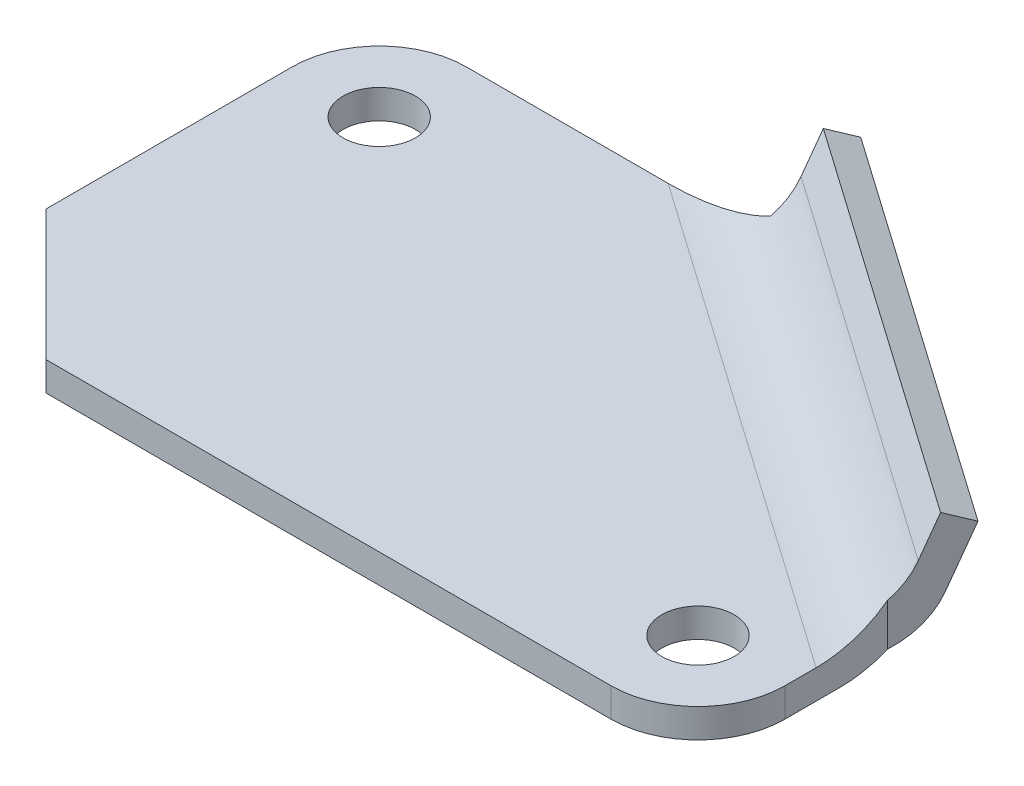
ISO-10303-21;
HEADER;
FILE_DESCRIPTION(('STEP AP214'),'2;1');
FILE_NAME('part.step','',(''),(''),'','','');
FILE_SCHEMA(('AUTOMOTIVE_DESIGN { 1 0 10303 214 1 1 1 1 }'));
ENDSEC;
DATA;
#1=APPLICATION_CONTEXT('core data for automotive mechanical design processes');
#2=APPLICATION_PROTOCOL_DEFINITION('international standard','automotive_design',2000,#1);
#3=PRODUCT_CONTEXT('',#1,'mechanical');
#4=PRODUCT('Part','Part','',(#3));
#5=PRODUCT_RELATED_PRODUCT_CATEGORY('part','',(#4));
#6=PRODUCT_DEFINITION_FORMATION('','',#4);
#7=PRODUCT_DEFINITION_CONTEXT('part definition',#1,'design');
#8=PRODUCT_DEFINITION('design','',#6,#7);
#9=PRODUCT_DEFINITION_SHAPE('','',#8);
#10=(LENGTH_UNIT() NAMED_UNIT(*) SI_UNIT(.MILLI.,.METRE.));
#11=(NAMED_UNIT(*) PLANE_ANGLE_UNIT() SI_UNIT($,.RADIAN.));
#12=(NAMED_UNIT(*) SI_UNIT($,.STERADIAN.) SOLID_ANGLE_UNIT());
#13=UNCERTAINTY_MEASURE_WITH_UNIT(LENGTH_MEASURE(1.E-05),#10,'distance_accuracy_value','');
#14=(GEOMETRIC_REPRESENTATION_CONTEXT(3) GLOBAL_UNCERTAINTY_ASSIGNED_CONTEXT((#13)) GLOBAL_UNIT_ASSIGNED_CONTEXT((#10,
#11,#12)) REPRESENTATION_CONTEXT('',''));
#15=CARTESIAN_POINT('',(0.,0.,0.));
#16=DIRECTION('',(0.,0.,1.));
#17=DIRECTION('',(1.,0.,0.));
#18=AXIS2_PLACEMENT_3D('',#15,#16,#17);
#19=CARTESIAN_POINT('',(96.,2.,-12.));
#20=DIRECTION('',(0.,1.,0.));
#21=DIRECTION('',(0.,0.,1.));
#22=AXIS2_PLACEMENT_3D('',#19,#20,#21);
#23=PLANE('',#22);
#24=CARTESIAN_POINT('',(12.,2.,-52.));
#25=DIRECTION('',(0.,1.,0.));
#26=DIRECTION('',(0.,0.,1.));
#27=AXIS2_PLACEMENT_3D('',#24,#25,#26);
#28=CIRCLE('',#27,5.);
#29=CARTESIAN_POINT('',(12.,2.,-47.));
#30=VERTEX_POINT('',#29);
#31=EDGE_CURVE('E194',#30,#30,#28,.T.);
#32=ORIENTED_EDGE('',*,*,#31,.F.);
#33=EDGE_LOOP('',(#32));
#34=FACE_BOUND('',#33,.T.);
#35=DIRECTION('',(0.,0.,-1.));
#36=VECTOR('',#35,1.);
#37=CARTESIAN_POINT('',(108.,2.,-12.0000000000001));
#38=LINE('',#37,#36);
#39=CARTESIAN_POINT('',(108.,2.,-12.0000000000001));
#40=VERTEX_POINT('',#39);
#41=CARTESIAN_POINT('',(108.,2.,-16.3077186495026));
#42=VERTEX_POINT('',#41);
#43=EDGE_CURVE('E206',#40,#42,#38,.T.);
#44=ORIENTED_EDGE('',*,*,#43,.T.);
#45=DIRECTION('',(-0.819152044288989,0.,-0.57357643635105));
#46=VECTOR('',#45,1.);
#47=CARTESIAN_POINT('',(49.3574137034532,2.,-57.3696996344585));
#48=LINE('',#47,#46);
#49=CARTESIAN_POINT('',(39.8883634523036,2.,-64.));
#50=VERTEX_POINT('',#49);
#51=EDGE_CURVE('E293',#42,#50,#48,.T.);
#52=ORIENTED_EDGE('',*,*,#51,.T.);
#53=DIRECTION('',(-1.,0.,0.));
#54=VECTOR('',#53,1.);
#55=CARTESIAN_POINT('',(12.0000000000001,2.,-64.));
#56=LINE('',#55,#54);
#57=CARTESIAN_POINT('',(12.,2.,-64.));
#58=VERTEX_POINT('',#57);
#59=EDGE_CURVE('E211',#50,#58,#56,.T.);
#60=ORIENTED_EDGE('',*,*,#59,.T.);
#61=CARTESIAN_POINT('',(12.,2.,-52.));
#62=DIRECTION('',(0.,1.,0.));
#63=DIRECTION('',(0.,0.,-1.));
#64=AXIS2_PLACEMENT_3D('',#61,#62,#63);
#65=CIRCLE('',#64,12.);
#66=CARTESIAN_POINT('',(0.,2.,-51.9999999999999));
#67=VERTEX_POINT('',#66);
#68=EDGE_CURVE('E214',#58,#67,#65,.T.);
#69=ORIENTED_EDGE('',*,*,#68,.T.);
#70=DIRECTION('',(0.,0.,1.));
#71=VECTOR('',#70,1.);
#72=CARTESIAN_POINT('',(0.,2.,-18.));
#73=LINE('',#72,#71);
#74=CARTESIAN_POINT('',(0.,2.,-18.));
#75=VERTEX_POINT('',#74);
#76=EDGE_CURVE('E217',#67,#75,#73,.T.);
#77=ORIENTED_EDGE('',*,*,#76,.T.);
#78=DIRECTION('',(0.707106781186547,0.,0.707106781186547));
#79=VECTOR('',#78,1.);
#80=CARTESIAN_POINT('',(0.,2.,-18.));
#81=LINE('',#80,#79);
#82=CARTESIAN_POINT('',(18.,2.,0.));
#83=VERTEX_POINT('',#82);
#84=EDGE_CURVE('E220',#75,#83,#81,.T.);
#85=ORIENTED_EDGE('',*,*,#84,.T.);
#86=DIRECTION('',(1.,0.,0.));
#87=VECTOR('',#86,1.);
#88=CARTESIAN_POINT('',(18.,2.,0.));
#89=LINE('',#88,#87);
#90=CARTESIAN_POINT('',(95.9999999999999,2.,0.));
#91=VERTEX_POINT('',#90);
#92=EDGE_CURVE('E223',#83,#91,#89,.T.);
#93=ORIENTED_EDGE('',*,*,#92,.T.);
#94=CARTESIAN_POINT('',(96.,2.,-12.));
#95=DIRECTION('',(0.,1.,0.));
#96=DIRECTION('',(0.,0.,1.));
#97=AXIS2_PLACEMENT_3D('',#94,#95,#96);
#98=CIRCLE('',#97,12.);
#99=EDGE_CURVE('E202',#91,#40,#98,.T.);
#100=ORIENTED_EDGE('',*,*,#99,.T.);
#101=EDGE_LOOP('',(#44,#52,#60,#69,#77,#85,#93,#100));
#102=FACE_BOUND('',#101,.T.);
#103=CARTESIAN_POINT('',(96.,2.,-12.));
#104=DIRECTION('',(0.,1.,0.));
#105=DIRECTION('',(0.,0.,1.));
#106=AXIS2_PLACEMENT_3D('',#103,#104,#105);
#107=CIRCLE('',#106,5.);
#108=CARTESIAN_POINT('',(96.,2.,-6.99999999999999));
#109=VERTEX_POINT('',#108);
#110=EDGE_CURVE('E186',#109,#109,#107,.T.);
#111=ORIENTED_EDGE('',*,*,#110,.F.);
#112=EDGE_LOOP('',(#111));
#113=FACE_BOUND('',#112,.T.);
#114=ADVANCED_FACE('F43',(#34,#102,#113),#23,.T.);
#115=CARTESIAN_POINT('',(96.,-2.,-12.));
#116=DIRECTION('',(0.,1.,0.));
#117=DIRECTION('',(0.,0.,1.));
#118=AXIS2_PLACEMENT_3D('',#115,#116,#117);
#119=PLANE('',#118);
#120=DIRECTION('',(-1.,0.,0.));
#121=VECTOR('',#120,1.);
#122=CARTESIAN_POINT('',(12.0000000000001,-2.,-64.));
#123=LINE('',#122,#121);
#124=CARTESIAN_POINT('',(44.5922423015359,-2.,-64.));
#125=VERTEX_POINT('',#124);
#126=CARTESIAN_POINT('',(12.,-2.,-64.));
#127=VERTEX_POINT('',#126);
#128=EDGE_CURVE('E234',#125,#127,#123,.T.);
#129=ORIENTED_EDGE('',*,*,#128,.F.);
#130=DIRECTION('',(0.819152044288989,0.,0.57357643635105));
#131=VECTOR('',#130,1.);
#132=CARTESIAN_POINT('',(104.904942468969,-2.,-21.7685926929811));
#133=LINE('',#132,#131);
#134=CARTESIAN_POINT('',(108.,-2.,-19.6014100785602));
#135=VERTEX_POINT('',#134);
#136=EDGE_CURVE('E275',#125,#135,#133,.T.);
#137=ORIENTED_EDGE('',*,*,#136,.T.);
#138=DIRECTION('',(0.,0.,-1.));
#139=VECTOR('',#138,1.);
#140=CARTESIAN_POINT('',(108.,-2.,-12.0000000000001));
#141=LINE('',#140,#139);
#142=CARTESIAN_POINT('',(108.,-2.,-12.0000000000001));
#143=VERTEX_POINT('',#142);
#144=EDGE_CURVE('E230',#143,#135,#141,.T.);
#145=ORIENTED_EDGE('',*,*,#144,.F.);
#146=CARTESIAN_POINT('',(96.,-2.,-12.));
#147=DIRECTION('',(0.,1.,0.));
#148=DIRECTION('',(0.,0.,1.));
#149=AXIS2_PLACEMENT_3D('',#146,#147,#148);
#150=CIRCLE('',#149,12.);
#151=CARTESIAN_POINT('',(95.9999999999999,-2.,0.));
#152=VERTEX_POINT('',#151);
#153=EDGE_CURVE('E198',#152,#143,#150,.T.);
#154=ORIENTED_EDGE('',*,*,#153,.F.);
#155=DIRECTION('',(1.,0.,0.));
#156=VECTOR('',#155,1.);
#157=CARTESIAN_POINT('',(18.,-2.,0.));
#158=LINE('',#157,#156);
#159=CARTESIAN_POINT('',(18.,-2.,0.));
#160=VERTEX_POINT('',#159);
#161=EDGE_CURVE('E207',#160,#152,#158,.T.);
#162=ORIENTED_EDGE('',*,*,#161,.F.);
#163=DIRECTION('',(0.707106781186547,0.,0.707106781186547));
#164=VECTOR('',#163,1.);
#165=CARTESIAN_POINT('',(0.,-2.,-18.));
#166=LINE('',#165,#164);
#167=CARTESIAN_POINT('',(0.,-2.,-18.));
#168=VERTEX_POINT('',#167);
#169=EDGE_CURVE('E243',#168,#160,#166,.T.);
#170=ORIENTED_EDGE('',*,*,#169,.F.);
#171=DIRECTION('',(0.,0.,1.));
#172=VECTOR('',#171,1.);
#173=CARTESIAN_POINT('',(0.,-2.,-18.));
#174=LINE('',#173,#172);
#175=CARTESIAN_POINT('',(0.,-2.,-51.9999999999999));
#176=VERTEX_POINT('',#175);
#177=EDGE_CURVE('E240',#176,#168,#174,.T.);
#178=ORIENTED_EDGE('',*,*,#177,.F.);
#179=CARTESIAN_POINT('',(12.,-2.,-52.));
#180=DIRECTION('',(0.,1.,0.));
#181=DIRECTION('',(0.,0.,-1.));
#182=AXIS2_PLACEMENT_3D('',#179,#180,#181);
#183=CIRCLE('',#182,12.);
#184=EDGE_CURVE('E237',#127,#176,#183,.T.);
#185=ORIENTED_EDGE('',*,*,#184,.F.);
#186=EDGE_LOOP('',(#129,#137,#145,#154,#162,#170,#178,#185));
#187=FACE_BOUND('',#186,.T.);
#188=CARTESIAN_POINT('',(12.,-2.,-52.));
#189=DIRECTION('',(0.,1.,0.));
#190=DIRECTION('',(0.,0.,1.));
#191=AXIS2_PLACEMENT_3D('',#188,#189,#190);
#192=CIRCLE('',#191,5.);
#193=CARTESIAN_POINT('',(12.,-2.,-47.));
#194=VERTEX_POINT('',#193);
#195=EDGE_CURVE('E190',#194,#194,#192,.T.);
#196=ORIENTED_EDGE('',*,*,#195,.T.);
#197=EDGE_LOOP('',(#196));
#198=FACE_BOUND('',#197,.T.);
#199=CARTESIAN_POINT('',(96.,-2.,-12.));
#200=DIRECTION('',(0.,1.,0.));
#201=DIRECTION('',(0.,0.,1.));
#202=AXIS2_PLACEMENT_3D('',#199,#200,#201);
#203=CIRCLE('',#202,5.);
#204=CARTESIAN_POINT('',(96.,-2.,-6.99999999999999));
#205=VERTEX_POINT('',#204);
#206=EDGE_CURVE('E184',#205,#205,#203,.T.);
#207=ORIENTED_EDGE('',*,*,#206,.T.);
#208=EDGE_LOOP('',(#207));
#209=FACE_BOUND('',#208,.T.);
#210=ADVANCED_FACE('F328',(#187,#198,#209),#119,.F.);
#211=CARTESIAN_POINT('',(96.,2.,-12.));
#212=DIRECTION('',(0.,-1.,0.));
#213=DIRECTION('',(0.,0.,-1.));
#214=AXIS2_PLACEMENT_3D('',#211,#212,#213);
#215=CYLINDRICAL_SURFACE('',#214,12.);
#216=ORIENTED_EDGE('',*,*,#153,.T.);
#217=DIRECTION('',(0.,-1.,0.));
#218=VECTOR('',#217,1.);
#219=CARTESIAN_POINT('',(108.,2.,-12.0000000000001));
#220=LINE('',#219,#218);
#221=EDGE_CURVE('E271',#40,#143,#220,.T.);
#222=ORIENTED_EDGE('',*,*,#221,.F.);
#223=ORIENTED_EDGE('',*,*,#99,.F.);
#224=DIRECTION('',(0.,-1.,0.));
#225=VECTOR('',#224,1.);
#226=CARTESIAN_POINT('',(95.9999999999999,2.,0.));
#227=LINE('',#226,#225);
#228=EDGE_CURVE('E226',#91,#152,#227,.T.);
#229=ORIENTED_EDGE('',*,*,#228,.T.);
#230=EDGE_LOOP('',(#216,#222,#223,#229));
#231=FACE_BOUND('',#230,.T.);
#232=ADVANCED_FACE('F324',(#231),#215,.T.);
#233=CARTESIAN_POINT('',(108.,2.,-12.0000000000001));
#234=DIRECTION('',(-1.,0.,0.));
#235=DIRECTION('',(0.,0.,1.));
#236=AXIS2_PLACEMENT_3D('',#233,#234,#235);
#237=PLANE('',#236);
#238=ORIENTED_EDGE('',*,*,#144,.T.);
#239=CARTESIAN_POINT('',(108.,10.,-19.6014100785602));
#240=DIRECTION('',(-1.,0.,0.));
#241=DIRECTION('',(0.,0.,-1.));
#242=AXIS2_PLACEMENT_3D('',#239,#240,#241);
#243=ELLIPSE('',#242,14.6492950651375,12.);
#244=CARTESIAN_POINT('',(108.,-0.718323035123066,-26.1887929366756));
#245=VERTEX_POINT('',#244);
#246=EDGE_CURVE('E279',#135,#245,#243,.F.);
#247=ORIENTED_EDGE('',*,*,#246,.T.);
#248=DIRECTION('',(0.,-1.,0.));
#249=VECTOR('',#248,1.);
#250=CARTESIAN_POINT('',(108.,2.,-26.1887929366756));
#251=LINE('',#250,#249);
#252=CARTESIAN_POINT('',(108.,5.14079520826996,-26.1887929366756));
#253=VERTEX_POINT('',#252);
#254=EDGE_CURVE('E58',#253,#245,#251,.T.);
#255=ORIENTED_EDGE('',*,*,#254,.F.);
#256=CARTESIAN_POINT('',(108.,14.,-16.3077186495026));
#257=DIRECTION('',(-1.,0.,0.));
#258=DIRECTION('',(0.,0.,1.));
#259=AXIS2_PLACEMENT_3D('',#256,#257,#258);
#260=ELLIPSE('',#259,14.6492950651375,12.);
#261=EDGE_CURVE('E11',#253,#42,#260,.T.);
#262=ORIENTED_EDGE('',*,*,#261,.T.);
#263=ORIENTED_EDGE('',*,*,#43,.F.);
#264=ORIENTED_EDGE('',*,*,#221,.T.);
#265=EDGE_LOOP('',(#238,#247,#255,#262,#263,#264));
#266=FACE_BOUND('',#265,.T.);
#267=ADVANCED_FACE('F315',(#266),#237,.F.);
#268=CARTESIAN_POINT('',(12.0000000000001,2.,-64.));
#269=DIRECTION('',(0.,0.,1.));
#270=DIRECTION('',(1.,0.,0.));
#271=AXIS2_PLACEMENT_3D('',#268,#269,#270);
#272=PLANE('',#271);
#273=DIRECTION('',(0.,-1.,0.));
#274=VECTOR('',#273,1.);
#275=CARTESIAN_POINT('',(54.,2.,-64.));
#276=LINE('',#275,#274);
#277=CARTESIAN_POINT('',(54.,5.14079520826979,-64.));
#278=VERTEX_POINT('',#277);
#279=CARTESIAN_POINT('',(54.,-0.718323035123179,-64.));
#280=VERTEX_POINT('',#279);
#281=EDGE_CURVE('E66',#278,#280,#276,.T.);
#282=ORIENTED_EDGE('',*,*,#281,.T.);
#283=CARTESIAN_POINT('',(44.5922423015359,10.,-64.));
#284=DIRECTION('',(0.,0.,1.));
#285=DIRECTION('',(-1.,0.,0.));
#286=AXIS2_PLACEMENT_3D('',#283,#284,#285);
#287=ELLIPSE('',#286,20.921361547453,12.);
#288=EDGE_CURVE('E290',#280,#125,#287,.F.);
#289=ORIENTED_EDGE('',*,*,#288,.T.);
#290=ORIENTED_EDGE('',*,*,#128,.T.);
#291=DIRECTION('',(0.,-1.,0.));
#292=VECTOR('',#291,1.);
#293=CARTESIAN_POINT('',(12.,2.,-64.));
#294=LINE('',#293,#292);
#295=EDGE_CURVE('E263',#58,#127,#294,.T.);
#296=ORIENTED_EDGE('',*,*,#295,.F.);
#297=ORIENTED_EDGE('',*,*,#59,.F.);
#298=CARTESIAN_POINT('',(39.8883634523036,14.,-64.));
#299=DIRECTION('',(0.,0.,1.));
#300=DIRECTION('',(1.,0.,0.));
#301=AXIS2_PLACEMENT_3D('',#298,#299,#300);
#302=ELLIPSE('',#301,20.921361547453,12.);
#303=EDGE_CURVE('E300',#50,#278,#302,.T.);
#304=ORIENTED_EDGE('',*,*,#303,.T.);
#305=EDGE_LOOP('',(#282,#289,#290,#296,#297,#304));
#306=FACE_BOUND('',#305,.T.);
#307=ADVANCED_FACE('F340',(#306),#272,.F.);
#308=CARTESIAN_POINT('',(12.,2.,-52.));
#309=DIRECTION('',(0.,-1.,0.));
#310=DIRECTION('',(0.,0.,-1.));
#311=AXIS2_PLACEMENT_3D('',#308,#309,#310);
#312=CYLINDRICAL_SURFACE('',#311,12.);
#313=ORIENTED_EDGE('',*,*,#184,.T.);
#314=DIRECTION('',(0.,-1.,0.));
#315=VECTOR('',#314,1.);
#316=CARTESIAN_POINT('',(0.,2.,-51.9999999999999));
#317=LINE('',#316,#315);
#318=EDGE_CURVE('E259',#67,#176,#317,.T.);
#319=ORIENTED_EDGE('',*,*,#318,.F.);
#320=ORIENTED_EDGE('',*,*,#68,.F.);
#321=ORIENTED_EDGE('',*,*,#295,.T.);
#322=EDGE_LOOP('',(#313,#319,#320,#321));
#323=FACE_BOUND('',#322,.T.);
#324=ADVANCED_FACE('F347',(#323),#312,.T.);
#325=CARTESIAN_POINT('',(0.,2.,-18.));
#326=DIRECTION('',(1.,0.,0.));
#327=DIRECTION('',(0.,0.,-1.));
#328=AXIS2_PLACEMENT_3D('',#325,#326,#327);
#329=PLANE('',#328);
#330=ORIENTED_EDGE('',*,*,#177,.T.);
#331=DIRECTION('',(0.,-1.,0.));
#332=VECTOR('',#331,1.);
#333=CARTESIAN_POINT('',(0.,2.,-18.));
#334=LINE('',#333,#332);
#335=EDGE_CURVE('E255',#75,#168,#334,.T.);
#336=ORIENTED_EDGE('',*,*,#335,.F.);
#337=ORIENTED_EDGE('',*,*,#76,.F.);
#338=ORIENTED_EDGE('',*,*,#318,.T.);
#339=EDGE_LOOP('',(#330,#336,#337,#338));
#340=FACE_BOUND('',#339,.T.);
#341=ADVANCED_FACE('F350',(#340),#329,.F.);
#342=CARTESIAN_POINT('',(0.,2.,-18.));
#343=DIRECTION('',(0.707106781186547,0.,-0.707106781186547));
#344=DIRECTION('',(-0.707106781186548,0.,-0.707106781186548));
#345=AXIS2_PLACEMENT_3D('',#342,#343,#344);
#346=PLANE('',#345);
#347=ORIENTED_EDGE('',*,*,#169,.T.);
#348=DIRECTION('',(0.,-1.,0.));
#349=VECTOR('',#348,1.);
#350=CARTESIAN_POINT('',(18.,2.,0.));
#351=LINE('',#350,#349);
#352=EDGE_CURVE('E251',#83,#160,#351,.T.);
#353=ORIENTED_EDGE('',*,*,#352,.F.);
#354=ORIENTED_EDGE('',*,*,#84,.F.);
#355=ORIENTED_EDGE('',*,*,#335,.T.);
#356=EDGE_LOOP('',(#347,#353,#354,#355));
#357=FACE_BOUND('',#356,.T.);
#358=ADVANCED_FACE('F355',(#357),#346,.F.);
#359=CARTESIAN_POINT('',(18.,2.,0.));
#360=DIRECTION('',(0.,0.,-1.));
#361=DIRECTION('',(-1.,0.,0.));
#362=AXIS2_PLACEMENT_3D('',#359,#360,#361);
#363=PLANE('',#362);
#364=ORIENTED_EDGE('',*,*,#161,.T.);
#365=ORIENTED_EDGE('',*,*,#228,.F.);
#366=ORIENTED_EDGE('',*,*,#92,.F.);
#367=ORIENTED_EDGE('',*,*,#352,.T.);
#368=EDGE_LOOP('',(#364,#365,#366,#367));
#369=FACE_BOUND('',#368,.T.);
#370=ADVANCED_FACE('F357',(#369),#363,.F.);
#371=CARTESIAN_POINT('',(12.,2.,-52.));
#372=DIRECTION('',(0.,-1.,0.));
#373=DIRECTION('',(0.,0.,-1.));
#374=AXIS2_PLACEMENT_3D('',#371,#372,#373);
#375=CYLINDRICAL_SURFACE('',#374,5.);
#376=ORIENTED_EDGE('',*,*,#31,.T.);
#377=EDGE_LOOP('',(#376));
#378=FACE_BOUND('',#377,.T.);
#379=ORIENTED_EDGE('',*,*,#195,.F.);
#380=EDGE_LOOP('',(#379));
#381=FACE_BOUND('',#380,.T.);
#382=ADVANCED_FACE('F359',(#378,#381),#375,.F.);
#383=CARTESIAN_POINT('',(96.,2.,-12.));
#384=DIRECTION('',(0.,-1.,0.));
#385=DIRECTION('',(0.,0.,-1.));
#386=AXIS2_PLACEMENT_3D('',#383,#384,#385);
#387=CYLINDRICAL_SURFACE('',#386,5.);
#388=ORIENTED_EDGE('',*,*,#110,.T.);
#389=EDGE_LOOP('',(#388));
#390=FACE_BOUND('',#389,.T.);
#391=ORIENTED_EDGE('',*,*,#206,.F.);
#392=EDGE_LOOP('',(#391));
#393=FACE_BOUND('',#392,.T.);
#394=ADVANCED_FACE('F365',(#390,#393),#387,.F.);
#395=CARTESIAN_POINT('',(54.0000000000001,2.,-64.0000000000002));
#396=DIRECTION('',(-0.531810811144649,0.37460659341591,0.759504549900129));
#397=DIRECTION('',(0.819152044288989,0.,0.57357643635105));
#398=AXIS2_PLACEMENT_3D('',#395,#396,#397);
#399=PLANE('',#398);
#400=DIRECTION('',(-0.214865514885103,-0.927183854566788,0.306859756800777));
#401=VECTOR('',#400,1.);
#402=CARTESIAN_POINT('',(54.0000000000001,2.,-64.0000000000002));
#403=LINE('',#402,#401);
#404=CARTESIAN_POINT('',(57.0081172083916,14.980573963935,-68.2960365952111));
#405=VERTEX_POINT('',#404);
#406=CARTESIAN_POINT('',(55.739143437189,9.50472087900908,-66.48375423326));
#407=VERTEX_POINT('',#406);
#408=EDGE_CURVE('E166',#405,#407,#403,.T.);
#409=ORIENTED_EDGE('',*,*,#408,.T.);
#410=DIRECTION('',(-0.819152044288989,0.,-0.57357643635105));
#411=VECTOR('',#410,1.);
#412=CARTESIAN_POINT('',(109.739143437189,9.50472087900908,-28.6725471699354));
#413=LINE('',#412,#411);
#414=CARTESIAN_POINT('',(109.739143437189,9.50472087900908,-28.6725471699354));
#415=VERTEX_POINT('',#414);
#416=EDGE_CURVE('E297',#407,#415,#413,.F.);
#417=ORIENTED_EDGE('',*,*,#416,.T.);
#418=DIRECTION('',(-0.214865514885103,-0.927183854566788,0.306859756800777));
#419=VECTOR('',#418,1.);
#420=CARTESIAN_POINT('',(108.,2.,-26.1887929366756));
#421=LINE('',#420,#419);
#422=CARTESIAN_POINT('',(111.008117208391,14.980573963935,-30.4848295318864));
#423=VERTEX_POINT('',#422);
#424=EDGE_CURVE('E156',#423,#415,#421,.T.);
#425=ORIENTED_EDGE('',*,*,#424,.F.);
#426=DIRECTION('',(0.819152044288989,0.,0.57357643635105));
#427=VECTOR('',#426,1.);
#428=CARTESIAN_POINT('',(57.0081172083916,14.980573963935,-68.2960365952111));
#429=LINE('',#428,#427);
#430=EDGE_CURVE('E165',#405,#423,#429,.T.);
#431=ORIENTED_EDGE('',*,*,#430,.F.);
#432=EDGE_LOOP('',(#409,#417,#425,#431));
#433=FACE_BOUND('',#432,.T.);
#434=ADVANCED_FACE('F337',(#433),#399,.T.);
#435=CARTESIAN_POINT('',(57.0081172083916,14.980573963935,-68.2960365952111));
#436=DIRECTION('',(0.214865514885104,0.927183854566788,-0.306859756800777));
#437=DIRECTION('',(0.,0.314198283252711,0.949357382022728));
#438=AXIS2_PLACEMENT_3D('',#435,#436,#437);
#439=PLANE('',#438);
#440=DIRECTION('',(-0.531810811144648,0.37460659341591,0.759504549900129));
#441=VECTOR('',#440,1.);
#442=CARTESIAN_POINT('',(111.008117208391,14.980573963935,-30.4848295318864));
#443=LINE('',#442,#441);
#444=CARTESIAN_POINT('',(113.13536045297,13.4821475902714,-33.522847731487));
#445=VERTEX_POINT('',#444);
#446=EDGE_CURVE('E163',#445,#423,#443,.T.);
#447=ORIENTED_EDGE('',*,*,#446,.F.);
#448=DIRECTION('',(0.819152044288989,0.,0.57357643635105));
#449=VECTOR('',#448,1.);
#450=CARTESIAN_POINT('',(59.1353604529702,13.4821475902714,-71.3340547948116));
#451=LINE('',#450,#449);
#452=CARTESIAN_POINT('',(59.1353604529702,13.4821475902714,-71.3340547948116));
#453=VERTEX_POINT('',#452);
#454=EDGE_CURVE('E148',#453,#445,#451,.T.);
#455=ORIENTED_EDGE('',*,*,#454,.F.);
#456=DIRECTION('',(-0.531810811144648,0.37460659341591,0.759504549900129));
#457=VECTOR('',#456,1.);
#458=CARTESIAN_POINT('',(57.0081172083916,14.980573963935,-68.2960365952111));
#459=LINE('',#458,#457);
#460=EDGE_CURVE('E155',#453,#405,#459,.T.);
#461=ORIENTED_EDGE('',*,*,#460,.T.);
#462=ORIENTED_EDGE('',*,*,#430,.T.);
#463=EDGE_LOOP('',(#447,#455,#461,#462));
#464=FACE_BOUND('',#463,.T.);
#465=ADVANCED_FACE('F160',(#464),#439,.T.);
#466=CARTESIAN_POINT('',(59.1353604529702,13.4821475902714,-71.3340547948116));
#467=DIRECTION('',(0.531810811144648,-0.37460659341591,-0.759504549900129));
#468=DIRECTION('',(-0.819152044288989,0.,-0.57357643635105));
#469=AXIS2_PLACEMENT_3D('',#466,#467,#468);
#470=PLANE('',#469);
#471=DIRECTION('',(0.214865514885104,0.927183854566788,-0.306859756800778));
#472=VECTOR('',#471,1.);
#473=CARTESIAN_POINT('',(113.13536045297,13.4821475902714,-33.522847731487));
#474=LINE('',#473,#472);
#475=CARTESIAN_POINT('',(111.286672202704,5.50472087900908,-30.8826472917826));
#476=VERTEX_POINT('',#475);
#477=EDGE_CURVE('E175',#476,#445,#474,.T.);
#478=ORIENTED_EDGE('',*,*,#477,.F.);
#479=DIRECTION('',(0.819152044288989,0.,0.57357643635105));
#480=VECTOR('',#479,1.);
#481=CARTESIAN_POINT('',(57.2866722027046,5.50472087900908,-68.6938543551073));
#482=LINE('',#481,#480);
#483=CARTESIAN_POINT('',(57.2866722027046,5.50472087900908,-68.6938543551073));
#484=VERTEX_POINT('',#483);
#485=EDGE_CURVE('E151',#476,#484,#482,.F.);
#486=ORIENTED_EDGE('',*,*,#485,.T.);
#487=DIRECTION('',(0.214865514885104,0.927183854566788,-0.306859756800778));
#488=VECTOR('',#487,1.);
#489=CARTESIAN_POINT('',(59.1353604529702,13.4821475902714,-71.3340547948116));
#490=LINE('',#489,#488);
#491=EDGE_CURVE('E144',#484,#453,#490,.T.);
#492=ORIENTED_EDGE('',*,*,#491,.T.);
#493=ORIENTED_EDGE('',*,*,#454,.T.);
#494=EDGE_LOOP('',(#478,#486,#492,#493));
#495=FACE_BOUND('',#494,.T.);
#496=ADVANCED_FACE('F147',(#495),#470,.T.);
#497=CARTESIAN_POINT('',(6.16438000464376,0.,4.31634534764072));
#498=DIRECTION('',(-0.81915204428899,0.,-0.573576436351049));
#499=DIRECTION('',(-0.573576436351049,0.,0.81915204428899));
#500=AXIS2_PLACEMENT_3D('',#497,#498,#499);
#501=PLANE('',#500);
#502=ORIENTED_EDGE('',*,*,#491,.F.);
#503=CARTESIAN_POINT('',(50.9049424689688,10.,-59.5797997563057));
#504=DIRECTION('',(-0.81915204428899,0.,-0.573576436351049));
#505=DIRECTION('',(-0.573576436351049,0.,0.81915204428899));
#506=AXIS2_PLACEMENT_3D('',#503,#504,#505);
#507=CIRCLE('',#506,12.);
#508=EDGE_CURVE('E287',#484,#280,#507,.T.);
#509=ORIENTED_EDGE('',*,*,#508,.T.);
#510=ORIENTED_EDGE('',*,*,#281,.F.);
#511=CARTESIAN_POINT('',(49.3574137034532,14.,-57.3696996344585));
#512=DIRECTION('',(-0.81915204428899,0.,-0.573576436351049));
#513=DIRECTION('',(-0.573576436351049,0.,0.81915204428899));
#514=AXIS2_PLACEMENT_3D('',#511,#512,#513);
#515=CIRCLE('',#514,12.);
#516=EDGE_CURVE('E303',#278,#407,#515,.F.);
#517=ORIENTED_EDGE('',*,*,#516,.T.);
#518=ORIENTED_EDGE('',*,*,#408,.F.);
#519=ORIENTED_EDGE('',*,*,#460,.F.);
#520=EDGE_LOOP('',(#502,#509,#510,#517,#518,#519));
#521=FACE_BOUND('',#520,.T.);
#522=ADVANCED_FACE('F168',(#521),#501,.T.);
#523=CARTESIAN_POINT('',(60.1643800046436,0.,42.1275524109653));
#524=DIRECTION('',(-0.81915204428899,0.,-0.573576436351049));
#525=DIRECTION('',(-0.573576436351049,0.,0.81915204428899));
#526=AXIS2_PLACEMENT_3D('',#523,#524,#525);
#527=PLANE('',#526);
#528=ORIENTED_EDGE('',*,*,#254,.T.);
#529=CARTESIAN_POINT('',(104.904942468969,10.,-21.7685926929811));
#530=DIRECTION('',(-0.81915204428899,0.,-0.573576436351049));
#531=DIRECTION('',(-0.573576436351049,0.,0.81915204428899));
#532=AXIS2_PLACEMENT_3D('',#529,#530,#531);
#533=CIRCLE('',#532,12.);
#534=EDGE_CURVE('E282',#245,#476,#533,.F.);
#535=ORIENTED_EDGE('',*,*,#534,.T.);
#536=ORIENTED_EDGE('',*,*,#477,.T.);
#537=ORIENTED_EDGE('',*,*,#446,.T.);
#538=ORIENTED_EDGE('',*,*,#424,.T.);
#539=CARTESIAN_POINT('',(103.357413703453,14.,-19.5584925711338));
#540=DIRECTION('',(-0.81915204428899,0.,-0.573576436351049));
#541=DIRECTION('',(-0.573576436351049,0.,0.81915204428899));
#542=AXIS2_PLACEMENT_3D('',#539,#540,#541);
#543=CIRCLE('',#542,12.);
#544=EDGE_CURVE('E52',#415,#253,#543,.T.);
#545=ORIENTED_EDGE('',*,*,#544,.T.);
#546=EDGE_LOOP('',(#528,#535,#536,#537,#538,#545));
#547=FACE_BOUND('',#546,.T.);
#548=ADVANCED_FACE('F309',(#547),#527,.F.);
#549=CARTESIAN_POINT('',(103.519373619241,10.,-22.7387784462687));
#550=DIRECTION('',(-0.819152044288989,0.,-0.57357643635105));
#551=DIRECTION('',(-0.57357643635105,0.,0.819152044288989));
#552=AXIS2_PLACEMENT_3D('',#549,#550,#551);
#553=CYLINDRICAL_SURFACE('',#552,12.);
#554=ORIENTED_EDGE('',*,*,#508,.F.);
#555=ORIENTED_EDGE('',*,*,#485,.F.);
#556=ORIENTED_EDGE('',*,*,#534,.F.);
#557=ORIENTED_EDGE('',*,*,#246,.F.);
#558=ORIENTED_EDGE('',*,*,#136,.F.);
#559=ORIENTED_EDGE('',*,*,#288,.F.);
#560=EDGE_LOOP('',(#554,#555,#556,#557,#558,#559));
#561=FACE_BOUND('',#560,.T.);
#562=ADVANCED_FACE('F335',(#561),#553,.T.);
#563=CARTESIAN_POINT('',(101.971844853726,14.,-20.5286783244215));
#564=DIRECTION('',(0.819152044288989,0.,0.57357643635105));
#565=DIRECTION('',(0.57357643635105,0.,-0.819152044288989));
#566=AXIS2_PLACEMENT_3D('',#563,#564,#565);
#567=CYLINDRICAL_SURFACE('',#566,12.);
#568=ORIENTED_EDGE('',*,*,#544,.F.);
#569=ORIENTED_EDGE('',*,*,#416,.F.);
#570=ORIENTED_EDGE('',*,*,#516,.F.);
#571=ORIENTED_EDGE('',*,*,#303,.F.);
#572=ORIENTED_EDGE('',*,*,#51,.F.);
#573=ORIENTED_EDGE('',*,*,#261,.F.);
#574=EDGE_LOOP('',(#568,#569,#570,#571,#572,#573));
#575=FACE_BOUND('',#574,.T.);
#576=ADVANCED_FACE('F45',(#575),#567,.F.);
#577=CLOSED_SHELL('',(#114,#210,#232,#267,#307,#324,#341,#358,#370,#382,#394,#434,#465,#496,
#522,#548,#562,#576));
#578=MANIFOLD_SOLID_BREP('B2',#577);
#579=ADVANCED_BREP_SHAPE_REPRESENTATION('',(#18,#578),#14);
#580=SHAPE_DEFINITION_REPRESENTATION(#9,#579);
ENDSEC;
END-ISO-10303-21;
